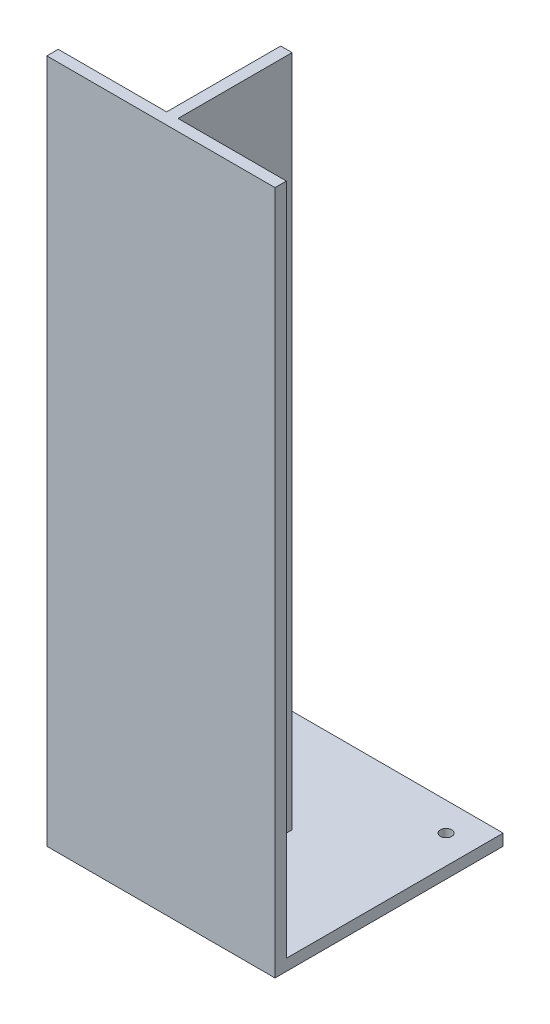
ISO-10303-21;
HEADER;
FILE_DESCRIPTION(('STEP AP214'),'2;1');
FILE_NAME('part.step','',(''),(''),'','','');
FILE_SCHEMA(('AUTOMOTIVE_DESIGN { 1 0 10303 214 1 1 1 1 }'));
ENDSEC;
DATA;
#1=APPLICATION_CONTEXT('core data for automotive mechanical design processes');
#2=APPLICATION_PROTOCOL_DEFINITION('international standard','automotive_design',2000,#1);
#3=PRODUCT_CONTEXT('',#1,'mechanical');
#4=PRODUCT('Part','Part','',(#3));
#5=PRODUCT_RELATED_PRODUCT_CATEGORY('part','',(#4));
#6=PRODUCT_DEFINITION_FORMATION('','',#4);
#7=PRODUCT_DEFINITION_CONTEXT('part definition',#1,'design');
#8=PRODUCT_DEFINITION('design','',#6,#7);
#9=PRODUCT_DEFINITION_SHAPE('','',#8);
#10=(LENGTH_UNIT() NAMED_UNIT(*) SI_UNIT(.MILLI.,.METRE.));
#11=(NAMED_UNIT(*) PLANE_ANGLE_UNIT() SI_UNIT($,.RADIAN.));
#12=(NAMED_UNIT(*) SI_UNIT($,.STERADIAN.) SOLID_ANGLE_UNIT());
#13=UNCERTAINTY_MEASURE_WITH_UNIT(LENGTH_MEASURE(1.E-05),#10,'distance_accuracy_value','');
#14=(GEOMETRIC_REPRESENTATION_CONTEXT(3) GLOBAL_UNCERTAINTY_ASSIGNED_CONTEXT((#13)) GLOBAL_UNIT_ASSIGNED_CONTEXT((#10,
#11,#12)) REPRESENTATION_CONTEXT('',''));
#15=CARTESIAN_POINT('',(0.,0.,0.));
#16=DIRECTION('',(0.,0.,1.));
#17=DIRECTION('',(1.,0.,0.));
#18=AXIS2_PLACEMENT_3D('',#15,#16,#17);
#19=CARTESIAN_POINT('',(-200.,-296.645569620253,-10.));
#20=DIRECTION('',(0.,0.,-1.));
#21=DIRECTION('',(0.,1.,0.));
#22=AXIS2_PLACEMENT_3D('',#19,#20,#21);
#23=PLANE('',#22);
#24=DIRECTION('',(1.,0.,0.));
#25=VECTOR('',#24,1.);
#26=CARTESIAN_POINT('',(-200.,-296.645569620253,-10.));
#27=LINE('',#26,#25);
#28=CARTESIAN_POINT('',(-95.,-296.645569620253,-10.));
#29=VERTEX_POINT('',#28);
#30=CARTESIAN_POINT('',(0.,-296.645569620253,-10.));
#31=VERTEX_POINT('',#30);
#32=EDGE_CURVE('E127',#29,#31,#27,.T.);
#33=ORIENTED_EDGE('',*,*,#32,.F.);
#34=DIRECTION('',(0.,-1.,0.));
#35=VECTOR('',#34,1.);
#36=CARTESIAN_POINT('',(-95.,293.354430379747,-10.));
#37=LINE('',#36,#35);
#38=CARTESIAN_POINT('',(-95.,293.354430379747,-10.));
#39=VERTEX_POINT('',#38);
#40=EDGE_CURVE('E151',#39,#29,#37,.T.);
#41=ORIENTED_EDGE('',*,*,#40,.F.);
#42=DIRECTION('',(1.,0.,0.));
#43=VECTOR('',#42,1.);
#44=CARTESIAN_POINT('',(-200.,293.354430379747,-10.));
#45=LINE('',#44,#43);
#46=CARTESIAN_POINT('',(0.,293.354430379747,-10.));
#47=VERTEX_POINT('',#46);
#48=EDGE_CURVE('E93',#39,#47,#45,.T.);
#49=ORIENTED_EDGE('',*,*,#48,.T.);
#50=DIRECTION('',(0.,1.,0.));
#51=VECTOR('',#50,1.);
#52=CARTESIAN_POINT('',(0.,-296.645569620253,-10.));
#53=LINE('',#52,#51);
#54=EDGE_CURVE('E160',#31,#47,#53,.T.);
#55=ORIENTED_EDGE('',*,*,#54,.F.);
#56=EDGE_LOOP('',(#33,#41,#49,#55));
#57=FACE_BOUND('',#56,.T.);
#58=ADVANCED_FACE('F40',(#57),#23,.T.);
#59=CARTESIAN_POINT('',(-200.,293.354430379747,-10.));
#60=VERTEX_POINT('',#59);
#61=CARTESIAN_POINT('',(-105.,293.354430379747,-10.));
#62=VERTEX_POINT('',#61);
#63=EDGE_CURVE('E64',#60,#62,#45,.T.);
#64=ORIENTED_EDGE('',*,*,#63,.T.);
#65=DIRECTION('',(0.,-1.,0.));
#66=VECTOR('',#65,1.);
#67=CARTESIAN_POINT('',(-105.,293.354430379747,-10.));
#68=LINE('',#67,#66);
#69=CARTESIAN_POINT('',(-105.,-296.645569620253,-10.));
#70=VERTEX_POINT('',#69);
#71=EDGE_CURVE('E192',#62,#70,#68,.T.);
#72=ORIENTED_EDGE('',*,*,#71,.T.);
#73=CARTESIAN_POINT('',(-200.,-296.645569620253,-10.));
#74=VERTEX_POINT('',#73);
#75=EDGE_CURVE('E166',#74,#70,#27,.T.);
#76=ORIENTED_EDGE('',*,*,#75,.F.);
#77=DIRECTION('',(0.,1.,0.));
#78=VECTOR('',#77,1.);
#79=CARTESIAN_POINT('',(-200.,-296.645569620253,-10.));
#80=LINE('',#79,#78);
#81=EDGE_CURVE('E137',#74,#60,#80,.T.);
#82=ORIENTED_EDGE('',*,*,#81,.T.);
#83=EDGE_LOOP('',(#64,#72,#76,#82));
#84=FACE_BOUND('',#83,.T.);
#85=ADVANCED_FACE('F222',(#84),#23,.T.);
#86=CARTESIAN_POINT('',(-200.,-296.645569620253,-200.));
#87=DIRECTION('',(0.,1.,0.));
#88=DIRECTION('',(0.,0.,1.));
#89=AXIS2_PLACEMENT_3D('',#86,#87,#88);
#90=PLANE('',#89);
#91=CARTESIAN_POINT('',(-175.,-296.645569620253,-25.));
#92=DIRECTION('',(0.,1.,0.));
#93=DIRECTION('',(0.,0.,1.));
#94=AXIS2_PLACEMENT_3D('',#91,#92,#93);
#95=CIRCLE('',#94,5.00000000000002);
#96=CARTESIAN_POINT('',(-175.,-296.645569620253,-20.));
#97=VERTEX_POINT('',#96);
#98=EDGE_CURVE('E210',#97,#97,#95,.F.);
#99=ORIENTED_EDGE('',*,*,#98,.T.);
#100=EDGE_LOOP('',(#99));
#101=FACE_BOUND('',#100,.T.);
#102=CARTESIAN_POINT('',(-25.,-296.645569620253,-25.));
#103=DIRECTION('',(0.,1.,0.));
#104=DIRECTION('',(0.,0.,1.));
#105=AXIS2_PLACEMENT_3D('',#102,#103,#104);
#106=CIRCLE('',#105,5.);
#107=CARTESIAN_POINT('',(-25.,-296.645569620253,-20.));
#108=VERTEX_POINT('',#107);
#109=EDGE_CURVE('E215',#108,#108,#106,.F.);
#110=ORIENTED_EDGE('',*,*,#109,.T.);
#111=EDGE_LOOP('',(#110));
#112=FACE_BOUND('',#111,.T.);
#113=CARTESIAN_POINT('',(-25.,-296.645569620253,-175.));
#114=DIRECTION('',(0.,1.,0.));
#115=DIRECTION('',(0.,0.,1.));
#116=AXIS2_PLACEMENT_3D('',#113,#114,#115);
#117=CIRCLE('',#116,5.);
#118=CARTESIAN_POINT('',(-25.,-296.645569620253,-170.));
#119=VERTEX_POINT('',#118);
#120=EDGE_CURVE('E347',#119,#119,#117,.F.);
#121=ORIENTED_EDGE('',*,*,#120,.T.);
#122=EDGE_LOOP('',(#121));
#123=FACE_BOUND('',#122,.T.);
#124=CARTESIAN_POINT('',(-175.,-296.645569620253,-175.));
#125=DIRECTION('',(0.,1.,0.));
#126=DIRECTION('',(0.,0.,1.));
#127=AXIS2_PLACEMENT_3D('',#124,#125,#126);
#128=CIRCLE('',#127,5.00000000000002);
#129=CARTESIAN_POINT('',(-175.,-296.645569620253,-170.));
#130=VERTEX_POINT('',#129);
#131=EDGE_CURVE('E344',#130,#130,#128,.F.);
#132=ORIENTED_EDGE('',*,*,#131,.T.);
#133=EDGE_LOOP('',(#132));
#134=FACE_BOUND('',#133,.T.);
#135=DIRECTION('',(1.,0.,0.));
#136=VECTOR('',#135,1.);
#137=CARTESIAN_POINT('',(-200.,-296.645569620253,-110.));
#138=LINE('',#137,#136);
#139=CARTESIAN_POINT('',(-105.,-296.645569620253,-110.));
#140=VERTEX_POINT('',#139);
#141=CARTESIAN_POINT('',(-95.,-296.645569620253,-110.));
#142=VERTEX_POINT('',#141);
#143=EDGE_CURVE('E48',#140,#142,#138,.T.);
#144=ORIENTED_EDGE('',*,*,#143,.T.);
#145=DIRECTION('',(0.,0.,1.));
#146=VECTOR('',#145,1.);
#147=CARTESIAN_POINT('',(-95.,-296.645569620253,-200.));
#148=LINE('',#147,#146);
#149=EDGE_CURVE('E11',#142,#29,#148,.T.);
#150=ORIENTED_EDGE('',*,*,#149,.T.);
#151=ORIENTED_EDGE('',*,*,#32,.T.);
#152=DIRECTION('',(0.,0.,1.));
#153=VECTOR('',#152,1.);
#154=CARTESIAN_POINT('',(0.,-296.645569620253,-200.));
#155=LINE('',#154,#153);
#156=CARTESIAN_POINT('',(0.,-296.645569620253,-200.));
#157=VERTEX_POINT('',#156);
#158=EDGE_CURVE('E122',#157,#31,#155,.T.);
#159=ORIENTED_EDGE('',*,*,#158,.F.);
#160=DIRECTION('',(1.,0.,0.));
#161=VECTOR('',#160,1.);
#162=CARTESIAN_POINT('',(-200.,-296.645569620253,-200.));
#163=LINE('',#162,#161);
#164=CARTESIAN_POINT('',(-200.,-296.645569620253,-200.));
#165=VERTEX_POINT('',#164);
#166=EDGE_CURVE('E114',#165,#157,#163,.T.);
#167=ORIENTED_EDGE('',*,*,#166,.F.);
#168=DIRECTION('',(0.,0.,1.));
#169=VECTOR('',#168,1.);
#170=CARTESIAN_POINT('',(-200.,-296.645569620253,-200.));
#171=LINE('',#170,#169);
#172=EDGE_CURVE('E119',#165,#74,#171,.T.);
#173=ORIENTED_EDGE('',*,*,#172,.T.);
#174=ORIENTED_EDGE('',*,*,#75,.T.);
#175=DIRECTION('',(0.,0.,-1.));
#176=VECTOR('',#175,1.);
#177=CARTESIAN_POINT('',(-105.,-296.645569620253,-200.));
#178=LINE('',#177,#176);
#179=EDGE_CURVE('E165',#70,#140,#178,.T.);
#180=ORIENTED_EDGE('',*,*,#179,.T.);
#181=EDGE_LOOP('',(#144,#150,#151,#159,#167,#173,#174,#180));
#182=FACE_BOUND('',#181,.T.);
#183=ADVANCED_FACE('F117',(#101,#112,#123,#134,#182),#90,.T.);
#184=CARTESIAN_POINT('',(-200.,293.354430379747,-10.));
#185=DIRECTION('',(0.,1.,0.));
#186=DIRECTION('',(0.,0.,1.));
#187=AXIS2_PLACEMENT_3D('',#184,#185,#186);
#188=PLANE('',#187);
#189=DIRECTION('',(0.,0.,1.));
#190=VECTOR('',#189,1.);
#191=CARTESIAN_POINT('',(0.,293.354430379747,-10.));
#192=LINE('',#191,#190);
#193=CARTESIAN_POINT('',(0.,293.354430379747,0.));
#194=VERTEX_POINT('',#193);
#195=EDGE_CURVE('E147',#47,#194,#192,.T.);
#196=ORIENTED_EDGE('',*,*,#195,.F.);
#197=ORIENTED_EDGE('',*,*,#48,.F.);
#198=DIRECTION('',(0.,0.,-1.));
#199=VECTOR('',#198,1.);
#200=CARTESIAN_POINT('',(-95.,293.354430379747,-110.));
#201=LINE('',#200,#199);
#202=CARTESIAN_POINT('',(-95.,293.354430379747,-110.));
#203=VERTEX_POINT('',#202);
#204=EDGE_CURVE('E208',#39,#203,#201,.T.);
#205=ORIENTED_EDGE('',*,*,#204,.T.);
#206=DIRECTION('',(-1.,0.,0.));
#207=VECTOR('',#206,1.);
#208=CARTESIAN_POINT('',(-105.,293.354430379747,-110.));
#209=LINE('',#208,#207);
#210=CARTESIAN_POINT('',(-105.,293.354430379747,-110.));
#211=VERTEX_POINT('',#210);
#212=EDGE_CURVE('E186',#203,#211,#209,.T.);
#213=ORIENTED_EDGE('',*,*,#212,.T.);
#214=DIRECTION('',(0.,0.,1.));
#215=VECTOR('',#214,1.);
#216=CARTESIAN_POINT('',(-105.,293.354430379747,-10.));
#217=LINE('',#216,#215);
#218=EDGE_CURVE('E212',#211,#62,#217,.T.);
#219=ORIENTED_EDGE('',*,*,#218,.T.);
#220=ORIENTED_EDGE('',*,*,#63,.F.);
#221=DIRECTION('',(0.,0.,1.));
#222=VECTOR('',#221,1.);
#223=CARTESIAN_POINT('',(-200.,293.354430379747,-10.));
#224=LINE('',#223,#222);
#225=CARTESIAN_POINT('',(-200.,293.354430379747,0.));
#226=VERTEX_POINT('',#225);
#227=EDGE_CURVE('E163',#60,#226,#224,.T.);
#228=ORIENTED_EDGE('',*,*,#227,.T.);
#229=DIRECTION('',(1.,0.,0.));
#230=VECTOR('',#229,1.);
#231=CARTESIAN_POINT('',(-200.,293.354430379747,0.));
#232=LINE('',#231,#230);
#233=EDGE_CURVE('E101',#226,#194,#232,.T.);
#234=ORIENTED_EDGE('',*,*,#233,.T.);
#235=EDGE_LOOP('',(#196,#197,#205,#213,#219,#220,#228,#234));
#236=FACE_BOUND('',#235,.T.);
#237=ADVANCED_FACE('F42',(#236),#188,.T.);
#238=CARTESIAN_POINT('',(-200.,-306.645569620253,-200.));
#239=DIRECTION('',(0.,0.,-1.));
#240=DIRECTION('',(-1.,0.,0.));
#241=AXIS2_PLACEMENT_3D('',#238,#239,#240);
#242=PLANE('',#241);
#243=DIRECTION('',(0.,1.,0.));
#244=VECTOR('',#243,1.);
#245=CARTESIAN_POINT('',(0.,-306.645569620253,-200.));
#246=LINE('',#245,#244);
#247=CARTESIAN_POINT('',(0.,-306.645569620253,-200.));
#248=VERTEX_POINT('',#247);
#249=EDGE_CURVE('E157',#248,#157,#246,.T.);
#250=ORIENTED_EDGE('',*,*,#249,.F.);
#251=DIRECTION('',(1.,0.,0.));
#252=VECTOR('',#251,1.);
#253=CARTESIAN_POINT('',(-200.,-306.645569620253,-200.));
#254=LINE('',#253,#252);
#255=CARTESIAN_POINT('',(-200.,-306.645569620253,-200.));
#256=VERTEX_POINT('',#255);
#257=EDGE_CURVE('E128',#256,#248,#254,.T.);
#258=ORIENTED_EDGE('',*,*,#257,.F.);
#259=DIRECTION('',(0.,1.,0.));
#260=VECTOR('',#259,1.);
#261=CARTESIAN_POINT('',(-200.,-306.645569620253,-200.));
#262=LINE('',#261,#260);
#263=EDGE_CURVE('E134',#256,#165,#262,.T.);
#264=ORIENTED_EDGE('',*,*,#263,.T.);
#265=ORIENTED_EDGE('',*,*,#166,.T.);
#266=EDGE_LOOP('',(#250,#258,#264,#265));
#267=FACE_BOUND('',#266,.T.);
#268=ADVANCED_FACE('F139',(#267),#242,.T.);
#269=CARTESIAN_POINT('',(-200.,-306.645569620253,0.));
#270=DIRECTION('',(0.,-1.,0.));
#271=DIRECTION('',(0.,0.,-1.));
#272=AXIS2_PLACEMENT_3D('',#269,#270,#271);
#273=PLANE('',#272);
#274=CARTESIAN_POINT('',(-175.,-306.645569620253,-25.));
#275=DIRECTION('',(0.,1.,0.));
#276=DIRECTION('',(0.,0.,1.));
#277=AXIS2_PLACEMENT_3D('',#274,#275,#276);
#278=CIRCLE('',#277,5.00000000000002);
#279=CARTESIAN_POINT('',(-175.,-306.645569620253,-20.));
#280=VERTEX_POINT('',#279);
#281=EDGE_CURVE('E333',#280,#280,#278,.T.);
#282=ORIENTED_EDGE('',*,*,#281,.T.);
#283=EDGE_LOOP('',(#282));
#284=FACE_BOUND('',#283,.T.);
#285=CARTESIAN_POINT('',(-25.,-306.645569620253,-25.));
#286=DIRECTION('',(0.,1.,0.));
#287=DIRECTION('',(0.,0.,1.));
#288=AXIS2_PLACEMENT_3D('',#285,#286,#287);
#289=CIRCLE('',#288,5.);
#290=CARTESIAN_POINT('',(-25.,-306.645569620253,-20.));
#291=VERTEX_POINT('',#290);
#292=EDGE_CURVE('E334',#291,#291,#289,.T.);
#293=ORIENTED_EDGE('',*,*,#292,.T.);
#294=EDGE_LOOP('',(#293));
#295=FACE_BOUND('',#294,.T.);
#296=CARTESIAN_POINT('',(-25.,-306.645569620253,-175.));
#297=DIRECTION('',(0.,1.,0.));
#298=DIRECTION('',(0.,0.,1.));
#299=AXIS2_PLACEMENT_3D('',#296,#297,#298);
#300=CIRCLE('',#299,5.);
#301=CARTESIAN_POINT('',(-25.,-306.645569620253,-170.));
#302=VERTEX_POINT('',#301);
#303=EDGE_CURVE('E337',#302,#302,#300,.T.);
#304=ORIENTED_EDGE('',*,*,#303,.T.);
#305=EDGE_LOOP('',(#304));
#306=FACE_BOUND('',#305,.T.);
#307=CARTESIAN_POINT('',(-175.,-306.645569620253,-175.));
#308=DIRECTION('',(0.,1.,0.));
#309=DIRECTION('',(0.,0.,1.));
#310=AXIS2_PLACEMENT_3D('',#307,#308,#309);
#311=CIRCLE('',#310,5.00000000000002);
#312=CARTESIAN_POINT('',(-175.,-306.645569620253,-170.));
#313=VERTEX_POINT('',#312);
#314=EDGE_CURVE('E341',#313,#313,#311,.T.);
#315=ORIENTED_EDGE('',*,*,#314,.T.);
#316=EDGE_LOOP('',(#315));
#317=FACE_BOUND('',#316,.T.);
#318=DIRECTION('',(0.,0.,-1.));
#319=VECTOR('',#318,1.);
#320=CARTESIAN_POINT('',(0.,-306.645569620253,0.));
#321=LINE('',#320,#319);
#322=CARTESIAN_POINT('',(0.,-306.645569620253,0.));
#323=VERTEX_POINT('',#322);
#324=EDGE_CURVE('E154',#323,#248,#321,.T.);
#325=ORIENTED_EDGE('',*,*,#324,.F.);
#326=DIRECTION('',(1.,0.,0.));
#327=VECTOR('',#326,1.);
#328=CARTESIAN_POINT('',(-200.,-306.645569620253,0.));
#329=LINE('',#328,#327);
#330=CARTESIAN_POINT('',(-200.,-306.645569620253,0.));
#331=VERTEX_POINT('',#330);
#332=EDGE_CURVE('E169',#331,#323,#329,.T.);
#333=ORIENTED_EDGE('',*,*,#332,.F.);
#334=DIRECTION('',(0.,0.,-1.));
#335=VECTOR('',#334,1.);
#336=CARTESIAN_POINT('',(-200.,-306.645569620253,0.));
#337=LINE('',#336,#335);
#338=EDGE_CURVE('E140',#331,#256,#337,.T.);
#339=ORIENTED_EDGE('',*,*,#338,.T.);
#340=ORIENTED_EDGE('',*,*,#257,.T.);
#341=EDGE_LOOP('',(#325,#333,#339,#340));
#342=FACE_BOUND('',#341,.T.);
#343=ADVANCED_FACE('F248',(#284,#295,#306,#317,#342),#273,.T.);
#344=CARTESIAN_POINT('',(-200.,293.354430379747,0.));
#345=DIRECTION('',(0.,0.,1.));
#346=DIRECTION('',(1.,0.,0.));
#347=AXIS2_PLACEMENT_3D('',#344,#345,#346);
#348=PLANE('',#347);
#349=DIRECTION('',(0.,-1.,0.));
#350=VECTOR('',#349,1.);
#351=CARTESIAN_POINT('',(0.,293.354430379747,0.));
#352=LINE('',#351,#350);
#353=EDGE_CURVE('E150',#194,#323,#352,.T.);
#354=ORIENTED_EDGE('',*,*,#353,.F.);
#355=ORIENTED_EDGE('',*,*,#233,.F.);
#356=DIRECTION('',(0.,-1.,0.));
#357=VECTOR('',#356,1.);
#358=CARTESIAN_POINT('',(-200.,293.354430379747,0.));
#359=LINE('',#358,#357);
#360=EDGE_CURVE('E142',#226,#331,#359,.T.);
#361=ORIENTED_EDGE('',*,*,#360,.T.);
#362=ORIENTED_EDGE('',*,*,#332,.T.);
#363=EDGE_LOOP('',(#354,#355,#361,#362));
#364=FACE_BOUND('',#363,.T.);
#365=ADVANCED_FACE('F196',(#364),#348,.T.);
#366=CARTESIAN_POINT('',(-200.,0.,0.));
#367=DIRECTION('',(1.,0.,0.));
#368=DIRECTION('',(0.,0.,-1.));
#369=AXIS2_PLACEMENT_3D('',#366,#367,#368);
#370=PLANE('',#369);
#371=ORIENTED_EDGE('',*,*,#227,.F.);
#372=ORIENTED_EDGE('',*,*,#81,.F.);
#373=ORIENTED_EDGE('',*,*,#172,.F.);
#374=ORIENTED_EDGE('',*,*,#263,.F.);
#375=ORIENTED_EDGE('',*,*,#338,.F.);
#376=ORIENTED_EDGE('',*,*,#360,.F.);
#377=EDGE_LOOP('',(#371,#372,#373,#374,#375,#376));
#378=FACE_BOUND('',#377,.T.);
#379=ADVANCED_FACE('F132',(#378),#370,.F.);
#380=CARTESIAN_POINT('',(0.,0.,0.));
#381=DIRECTION('',(1.,0.,0.));
#382=DIRECTION('',(0.,0.,-1.));
#383=AXIS2_PLACEMENT_3D('',#380,#381,#382);
#384=PLANE('',#383);
#385=ORIENTED_EDGE('',*,*,#195,.T.);
#386=ORIENTED_EDGE('',*,*,#353,.T.);
#387=ORIENTED_EDGE('',*,*,#324,.T.);
#388=ORIENTED_EDGE('',*,*,#249,.T.);
#389=ORIENTED_EDGE('',*,*,#158,.T.);
#390=ORIENTED_EDGE('',*,*,#54,.T.);
#391=EDGE_LOOP('',(#385,#386,#387,#388,#389,#390));
#392=FACE_BOUND('',#391,.T.);
#393=ADVANCED_FACE('F199',(#392),#384,.T.);
#394=CARTESIAN_POINT('',(-95.,293.354430379747,-110.));
#395=DIRECTION('',(-1.,0.,0.));
#396=DIRECTION('',(0.,0.,1.));
#397=AXIS2_PLACEMENT_3D('',#394,#395,#396);
#398=PLANE('',#397);
#399=ORIENTED_EDGE('',*,*,#149,.F.);
#400=DIRECTION('',(0.,-1.,0.));
#401=VECTOR('',#400,1.);
#402=CARTESIAN_POINT('',(-95.,293.354430379747,-110.));
#403=LINE('',#402,#401);
#404=EDGE_CURVE('E183',#203,#142,#403,.T.);
#405=ORIENTED_EDGE('',*,*,#404,.F.);
#406=ORIENTED_EDGE('',*,*,#204,.F.);
#407=ORIENTED_EDGE('',*,*,#40,.T.);
#408=EDGE_LOOP('',(#399,#405,#406,#407));
#409=FACE_BOUND('',#408,.T.);
#410=ADVANCED_FACE('F209',(#409),#398,.F.);
#411=CARTESIAN_POINT('',(-105.,293.354430379747,-110.));
#412=DIRECTION('',(0.,0.,1.));
#413=DIRECTION('',(1.,0.,0.));
#414=AXIS2_PLACEMENT_3D('',#411,#412,#413);
#415=PLANE('',#414);
#416=ORIENTED_EDGE('',*,*,#143,.F.);
#417=DIRECTION('',(0.,-1.,0.));
#418=VECTOR('',#417,1.);
#419=CARTESIAN_POINT('',(-105.,293.354430379747,-110.));
#420=LINE('',#419,#418);
#421=EDGE_CURVE('E55',#211,#140,#420,.T.);
#422=ORIENTED_EDGE('',*,*,#421,.F.);
#423=ORIENTED_EDGE('',*,*,#212,.F.);
#424=ORIENTED_EDGE('',*,*,#404,.T.);
#425=EDGE_LOOP('',(#416,#422,#423,#424));
#426=FACE_BOUND('',#425,.T.);
#427=ADVANCED_FACE('F179',(#426),#415,.F.);
#428=CARTESIAN_POINT('',(-105.,293.354430379747,-10.));
#429=DIRECTION('',(1.,0.,0.));
#430=DIRECTION('',(0.,0.,-1.));
#431=AXIS2_PLACEMENT_3D('',#428,#429,#430);
#432=PLANE('',#431);
#433=ORIENTED_EDGE('',*,*,#179,.F.);
#434=ORIENTED_EDGE('',*,*,#71,.F.);
#435=ORIENTED_EDGE('',*,*,#218,.F.);
#436=ORIENTED_EDGE('',*,*,#421,.T.);
#437=EDGE_LOOP('',(#433,#434,#435,#436));
#438=FACE_BOUND('',#437,.T.);
#439=ADVANCED_FACE('F223',(#438),#432,.F.);
#440=CARTESIAN_POINT('',(-175.,293.354430379747,-175.));
#441=DIRECTION('',(0.,-1.,0.));
#442=DIRECTION('',(0.,0.,-1.));
#443=AXIS2_PLACEMENT_3D('',#440,#441,#442);
#444=CYLINDRICAL_SURFACE('',#443,5.00000000000002);
#445=ORIENTED_EDGE('',*,*,#131,.F.);
#446=EDGE_LOOP('',(#445));
#447=FACE_BOUND('',#446,.T.);
#448=ORIENTED_EDGE('',*,*,#314,.F.);
#449=EDGE_LOOP('',(#448));
#450=FACE_BOUND('',#449,.T.);
#451=ADVANCED_FACE('F225',(#447,#450),#444,.F.);
#452=CARTESIAN_POINT('',(-25.,293.354430379747,-175.));
#453=DIRECTION('',(0.,-1.,0.));
#454=DIRECTION('',(0.,0.,-1.));
#455=AXIS2_PLACEMENT_3D('',#452,#453,#454);
#456=CYLINDRICAL_SURFACE('',#455,5.);
#457=ORIENTED_EDGE('',*,*,#120,.F.);
#458=EDGE_LOOP('',(#457));
#459=FACE_BOUND('',#458,.T.);
#460=ORIENTED_EDGE('',*,*,#303,.F.);
#461=EDGE_LOOP('',(#460));
#462=FACE_BOUND('',#461,.T.);
#463=ADVANCED_FACE('F231',(#459,#462),#456,.F.);
#464=CARTESIAN_POINT('',(-25.,293.354430379747,-25.));
#465=DIRECTION('',(0.,-1.,0.));
#466=DIRECTION('',(0.,0.,-1.));
#467=AXIS2_PLACEMENT_3D('',#464,#465,#466);
#468=CYLINDRICAL_SURFACE('',#467,5.);
#469=ORIENTED_EDGE('',*,*,#109,.F.);
#470=EDGE_LOOP('',(#469));
#471=FACE_BOUND('',#470,.T.);
#472=ORIENTED_EDGE('',*,*,#292,.F.);
#473=EDGE_LOOP('',(#472));
#474=FACE_BOUND('',#473,.T.);
#475=ADVANCED_FACE('F305',(#471,#474),#468,.F.);
#476=CARTESIAN_POINT('',(-175.,293.354430379747,-25.));
#477=DIRECTION('',(0.,-1.,0.));
#478=DIRECTION('',(0.,0.,-1.));
#479=AXIS2_PLACEMENT_3D('',#476,#477,#478);
#480=CYLINDRICAL_SURFACE('',#479,5.00000000000002);
#481=ORIENTED_EDGE('',*,*,#98,.F.);
#482=EDGE_LOOP('',(#481));
#483=FACE_BOUND('',#482,.T.);
#484=ORIENTED_EDGE('',*,*,#281,.F.);
#485=EDGE_LOOP('',(#484));
#486=FACE_BOUND('',#485,.T.);
#487=ADVANCED_FACE('F315',(#483,#486),#480,.F.);
#488=CLOSED_SHELL('',(#58,#85,#183,#237,#268,#343,#365,#379,#393,#410,#427,#439,#451,#463,#475,#487));
#489=MANIFOLD_SOLID_BREP('B2',#488);
#490=ADVANCED_BREP_SHAPE_REPRESENTATION('',(#18,#489),#14);
#491=SHAPE_DEFINITION_REPRESENTATION(#9,#490);
ENDSEC;
END-ISO-10303-21;
